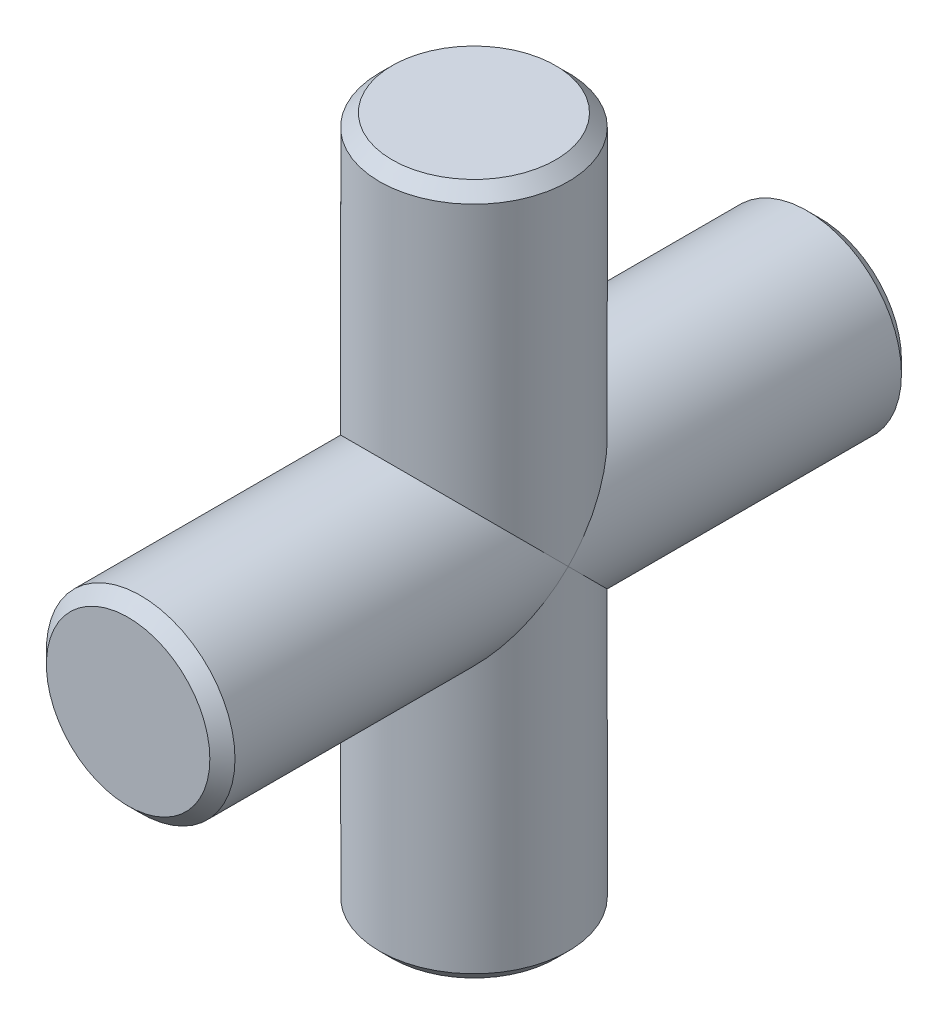
ISO-10303-21;
HEADER;
FILE_DESCRIPTION(('STEP AP214'),'2;1');
FILE_NAME('part.step','',(''),(''),'','','');
FILE_SCHEMA(('AUTOMOTIVE_DESIGN { 1 0 10303 214 1 1 1 1 }'));
ENDSEC;
DATA;
#1=APPLICATION_CONTEXT('core data for automotive mechanical design processes');
#2=APPLICATION_PROTOCOL_DEFINITION('international standard','automotive_design',2000,#1);
#3=PRODUCT_CONTEXT('',#1,'mechanical');
#4=PRODUCT('Part','Part','',(#3));
#5=PRODUCT_RELATED_PRODUCT_CATEGORY('part','',(#4));
#6=PRODUCT_DEFINITION_FORMATION('','',#4);
#7=PRODUCT_DEFINITION_CONTEXT('part definition',#1,'design');
#8=PRODUCT_DEFINITION('design','',#6,#7);
#9=PRODUCT_DEFINITION_SHAPE('','',#8);
#10=(LENGTH_UNIT() NAMED_UNIT(*) SI_UNIT(.MILLI.,.METRE.));
#11=(NAMED_UNIT(*) PLANE_ANGLE_UNIT() SI_UNIT($,.RADIAN.));
#12=(NAMED_UNIT(*) SI_UNIT($,.STERADIAN.) SOLID_ANGLE_UNIT());
#13=UNCERTAINTY_MEASURE_WITH_UNIT(LENGTH_MEASURE(1.E-05),#10,'distance_accuracy_value','');
#14=(GEOMETRIC_REPRESENTATION_CONTEXT(3) GLOBAL_UNCERTAINTY_ASSIGNED_CONTEXT((#13)) GLOBAL_UNIT_ASSIGNED_CONTEXT((#10,
#11,#12)) REPRESENTATION_CONTEXT('',''));
#15=CARTESIAN_POINT('',(0.,0.,0.));
#16=DIRECTION('',(0.,0.,1.));
#17=DIRECTION('',(1.,0.,0.));
#18=AXIS2_PLACEMENT_3D('',#15,#16,#17);
#19=CARTESIAN_POINT('',(0.,11.,0.));
#20=DIRECTION('',(0.,-1.,0.));
#21=DIRECTION('',(0.,0.,-1.));
#22=AXIS2_PLACEMENT_3D('',#19,#20,#21);
#23=CYLINDRICAL_SURFACE('',#22,1.5);
#24=CARTESIAN_POINT('',(0.,10.8,0.));
#25=DIRECTION('',(0.,1.,0.));
#26=DIRECTION('',(0.,0.,1.));
#27=AXIS2_PLACEMENT_3D('',#24,#25,#26);
#28=CIRCLE('',#27,1.5);
#29=CARTESIAN_POINT('',(0.,10.8,1.5));
#30=VERTEX_POINT('',#29);
#31=EDGE_CURVE('E11',#30,#30,#28,.F.);
#32=ORIENTED_EDGE('',*,*,#31,.T.);
#33=EDGE_LOOP('',(#32));
#34=FACE_BOUND('',#33,.T.);
#35=CARTESIAN_POINT('',(0.,5.5,0.));
#36=DIRECTION('',(0.,-0.707106781186547,-0.707106781186547));
#37=DIRECTION('',(0.,-0.707106781186547,0.707106781186547));
#38=AXIS2_PLACEMENT_3D('',#35,#36,#37);
#39=ELLIPSE('',#38,2.12132034355964,1.5);
#40=CARTESIAN_POINT('',(-1.5,5.5,0.));
#41=VERTEX_POINT('',#40);
#42=CARTESIAN_POINT('',(1.5,5.5,0.));
#43=VERTEX_POINT('',#42);
#44=EDGE_CURVE('E64',#41,#43,#39,.T.);
#45=ORIENTED_EDGE('',*,*,#44,.F.);
#46=CARTESIAN_POINT('',(0.,5.5,0.));
#47=DIRECTION('',(0.,-0.707106781186547,0.707106781186547));
#48=DIRECTION('',(0.,-0.707106781186547,-0.707106781186547));
#49=AXIS2_PLACEMENT_3D('',#46,#47,#48);
#50=ELLIPSE('',#49,2.12132034355964,1.5);
#51=EDGE_CURVE('E63',#43,#41,#50,.T.);
#52=ORIENTED_EDGE('',*,*,#51,.F.);
#53=EDGE_LOOP('',(#45,#52));
#54=FACE_BOUND('',#53,.T.);
#55=ADVANCED_FACE('F41',(#34,#54),#23,.T.);
#56=CARTESIAN_POINT('',(0.,11.,0.));
#57=DIRECTION('',(0.,1.,0.));
#58=DIRECTION('',(0.,0.,1.));
#59=AXIS2_PLACEMENT_3D('',#56,#57,#58);
#60=PLANE('',#59);
#61=CARTESIAN_POINT('',(0.,11.,0.));
#62=DIRECTION('',(0.,1.,0.));
#63=DIRECTION('',(0.,0.,1.));
#64=AXIS2_PLACEMENT_3D('',#61,#62,#63);
#65=CIRCLE('',#64,1.3);
#66=CARTESIAN_POINT('',(0.,11.,1.3));
#67=VERTEX_POINT('',#66);
#68=EDGE_CURVE('E51',#67,#67,#65,.T.);
#69=ORIENTED_EDGE('',*,*,#68,.T.);
#70=EDGE_LOOP('',(#69));
#71=FACE_BOUND('',#70,.T.);
#72=ADVANCED_FACE('F108',(#71),#60,.T.);
#73=CARTESIAN_POINT('',(0.,5.5,-5.5));
#74=DIRECTION('',(0.,0.,1.));
#75=DIRECTION('',(1.,0.,0.));
#76=AXIS2_PLACEMENT_3D('',#73,#74,#75);
#77=PLANE('',#76);
#78=CARTESIAN_POINT('',(0.,5.5,-5.5));
#79=DIRECTION('',(0.,0.,1.));
#80=DIRECTION('',(1.,0.,0.));
#81=AXIS2_PLACEMENT_3D('',#78,#79,#80);
#82=CIRCLE('',#81,1.3);
#83=CARTESIAN_POINT('',(1.3,5.5,-5.5));
#84=VERTEX_POINT('',#83);
#85=EDGE_CURVE('E101',#84,#84,#82,.F.);
#86=ORIENTED_EDGE('',*,*,#85,.T.);
#87=EDGE_LOOP('',(#86));
#88=FACE_BOUND('',#87,.T.);
#89=ADVANCED_FACE('F125',(#88),#77,.F.);
#90=CARTESIAN_POINT('',(0.,5.5,5.5));
#91=DIRECTION('',(0.,0.,-1.));
#92=DIRECTION('',(-1.,0.,0.));
#93=AXIS2_PLACEMENT_3D('',#90,#91,#92);
#94=CYLINDRICAL_SURFACE('',#93,1.5);
#95=CARTESIAN_POINT('',(0.,5.5,-5.3));
#96=DIRECTION('',(0.,0.,1.));
#97=DIRECTION('',(1.,0.,0.));
#98=AXIS2_PLACEMENT_3D('',#95,#96,#97);
#99=CIRCLE('',#98,1.5);
#100=CARTESIAN_POINT('',(1.5,5.5,-5.3));
#101=VERTEX_POINT('',#100);
#102=EDGE_CURVE('E97',#101,#101,#99,.T.);
#103=ORIENTED_EDGE('',*,*,#102,.T.);
#104=EDGE_LOOP('',(#103));
#105=FACE_BOUND('',#104,.T.);
#106=CARTESIAN_POINT('',(0.,5.5,0.));
#107=DIRECTION('',(0.,-0.707106781186547,0.707106781186547));
#108=DIRECTION('',(0.,-0.707106781186547,-0.707106781186547));
#109=AXIS2_PLACEMENT_3D('',#106,#107,#108);
#110=ELLIPSE('',#109,2.12132034355964,1.5);
#111=EDGE_CURVE('E57',#43,#41,#110,.F.);
#112=ORIENTED_EDGE('',*,*,#111,.T.);
#113=ORIENTED_EDGE('',*,*,#44,.T.);
#114=EDGE_LOOP('',(#112,#113));
#115=FACE_BOUND('',#114,.T.);
#116=ADVANCED_FACE('F74',(#105,#115),#94,.T.);
#117=CARTESIAN_POINT('',(0.,0.,0.));
#118=DIRECTION('',(0.,1.,0.));
#119=DIRECTION('',(0.,0.,1.));
#120=AXIS2_PLACEMENT_3D('',#117,#118,#119);
#121=PLANE('',#120);
#122=CARTESIAN_POINT('',(0.,0.,0.));
#123=DIRECTION('',(0.,1.,0.));
#124=DIRECTION('',(0.,0.,1.));
#125=AXIS2_PLACEMENT_3D('',#122,#123,#124);
#126=CIRCLE('',#125,1.3);
#127=CARTESIAN_POINT('',(0.,0.,1.3));
#128=VERTEX_POINT('',#127);
#129=EDGE_CURVE('E93',#128,#128,#126,.F.);
#130=ORIENTED_EDGE('',*,*,#129,.T.);
#131=EDGE_LOOP('',(#130));
#132=FACE_BOUND('',#131,.T.);
#133=ADVANCED_FACE('F130',(#132),#121,.F.);
#134=CARTESIAN_POINT('',(0.,0.200000000000001,0.));
#135=DIRECTION('',(0.,1.,0.));
#136=DIRECTION('',(0.,0.,1.));
#137=AXIS2_PLACEMENT_3D('',#134,#135,#136);
#138=CIRCLE('',#137,1.5);
#139=CARTESIAN_POINT('',(0.,0.200000000000001,1.5));
#140=VERTEX_POINT('',#139);
#141=EDGE_CURVE('E89',#140,#140,#138,.T.);
#142=ORIENTED_EDGE('',*,*,#141,.T.);
#143=EDGE_LOOP('',(#142));
#144=FACE_BOUND('',#143,.T.);
#145=CARTESIAN_POINT('',(0.,5.5,0.));
#146=DIRECTION('',(0.,-0.707106781186547,-0.707106781186547));
#147=DIRECTION('',(0.,-0.707106781186547,0.707106781186547));
#148=AXIS2_PLACEMENT_3D('',#145,#146,#147);
#149=ELLIPSE('',#148,2.12132034355964,1.5);
#150=EDGE_CURVE('E71',#41,#43,#149,.F.);
#151=ORIENTED_EDGE('',*,*,#150,.F.);
#152=ORIENTED_EDGE('',*,*,#111,.F.);
#153=EDGE_LOOP('',(#151,#152));
#154=FACE_BOUND('',#153,.T.);
#155=ADVANCED_FACE('F70',(#144,#154),#23,.T.);
#156=CARTESIAN_POINT('',(0.,5.5,5.3));
#157=DIRECTION('',(0.,0.,1.));
#158=DIRECTION('',(1.,0.,0.));
#159=AXIS2_PLACEMENT_3D('',#156,#157,#158);
#160=CIRCLE('',#159,1.5);
#161=CARTESIAN_POINT('',(1.5,5.5,5.3));
#162=VERTEX_POINT('',#161);
#163=EDGE_CURVE('E83',#162,#162,#160,.F.);
#164=ORIENTED_EDGE('',*,*,#163,.T.);
#165=EDGE_LOOP('',(#164));
#166=FACE_BOUND('',#165,.T.);
#167=ORIENTED_EDGE('',*,*,#51,.T.);
#168=ORIENTED_EDGE('',*,*,#150,.T.);
#169=EDGE_LOOP('',(#167,#168));
#170=FACE_BOUND('',#169,.T.);
#171=ADVANCED_FACE('F77',(#166,#170),#94,.T.);
#172=CARTESIAN_POINT('',(0.,5.5,5.5));
#173=DIRECTION('',(0.,0.,1.));
#174=DIRECTION('',(1.,0.,0.));
#175=AXIS2_PLACEMENT_3D('',#172,#173,#174);
#176=PLANE('',#175);
#177=CARTESIAN_POINT('',(0.,5.5,5.5));
#178=DIRECTION('',(0.,0.,1.));
#179=DIRECTION('',(1.,0.,0.));
#180=AXIS2_PLACEMENT_3D('',#177,#178,#179);
#181=CIRCLE('',#180,1.3);
#182=CARTESIAN_POINT('',(1.3,5.5,5.5));
#183=VERTEX_POINT('',#182);
#184=EDGE_CURVE('E79',#183,#183,#181,.T.);
#185=ORIENTED_EDGE('',*,*,#184,.T.);
#186=EDGE_LOOP('',(#185));
#187=FACE_BOUND('',#186,.T.);
#188=ADVANCED_FACE('F136',(#187),#176,.T.);
#189=CARTESIAN_POINT('',(0.,5.5,5.5));
#190=DIRECTION('',(0.,0.,-1.));
#191=DIRECTION('',(-1.,0.,0.));
#192=AXIS2_PLACEMENT_3D('',#189,#190,#191);
#193=CONICAL_SURFACE('',#192,1.3,0.785398163397445);
#194=ORIENTED_EDGE('',*,*,#163,.F.);
#195=EDGE_LOOP('',(#194));
#196=FACE_BOUND('',#195,.T.);
#197=ORIENTED_EDGE('',*,*,#184,.F.);
#198=EDGE_LOOP('',(#197));
#199=FACE_BOUND('',#198,.T.);
#200=ADVANCED_FACE('F143',(#196,#199),#193,.T.);
#201=CARTESIAN_POINT('',(0.,0.200000000000001,0.));
#202=DIRECTION('',(0.,1.,0.));
#203=DIRECTION('',(0.,0.,1.));
#204=AXIS2_PLACEMENT_3D('',#201,#202,#203);
#205=CONICAL_SURFACE('',#204,1.5,0.785398163397453);
#206=ORIENTED_EDGE('',*,*,#129,.F.);
#207=EDGE_LOOP('',(#206));
#208=FACE_BOUND('',#207,.T.);
#209=ORIENTED_EDGE('',*,*,#141,.F.);
#210=EDGE_LOOP('',(#209));
#211=FACE_BOUND('',#210,.T.);
#212=ADVANCED_FACE('F116',(#208,#211),#205,.T.);
#213=CARTESIAN_POINT('',(0.,5.5,-5.3));
#214=DIRECTION('',(0.,0.,1.));
#215=DIRECTION('',(1.,0.,0.));
#216=AXIS2_PLACEMENT_3D('',#213,#214,#215);
#217=CONICAL_SURFACE('',#216,1.5,0.785398163397453);
#218=ORIENTED_EDGE('',*,*,#85,.F.);
#219=EDGE_LOOP('',(#218));
#220=FACE_BOUND('',#219,.T.);
#221=ORIENTED_EDGE('',*,*,#102,.F.);
#222=EDGE_LOOP('',(#221));
#223=FACE_BOUND('',#222,.T.);
#224=ADVANCED_FACE('F111',(#220,#223),#217,.T.);
#225=CARTESIAN_POINT('',(0.,11.,0.));
#226=DIRECTION('',(0.,-1.,0.));
#227=DIRECTION('',(0.,0.,-1.));
#228=AXIS2_PLACEMENT_3D('',#225,#226,#227);
#229=CONICAL_SURFACE('',#228,1.3,0.785398163397445);
#230=ORIENTED_EDGE('',*,*,#31,.F.);
#231=EDGE_LOOP('',(#230));
#232=FACE_BOUND('',#231,.T.);
#233=ORIENTED_EDGE('',*,*,#68,.F.);
#234=EDGE_LOOP('',(#233));
#235=FACE_BOUND('',#234,.T.);
#236=ADVANCED_FACE('F44',(#232,#235),#229,.T.);
#237=CLOSED_SHELL('',(#55,#72,#89,#116,#133,#155,#171,#188,#200,#212,#224,#236));
#238=MANIFOLD_SOLID_BREP('B2',#237);
#239=ADVANCED_BREP_SHAPE_REPRESENTATION('',(#18,#238),#14);
#240=SHAPE_DEFINITION_REPRESENTATION(#9,#239);
ENDSEC;
END-ISO-10303-21;
